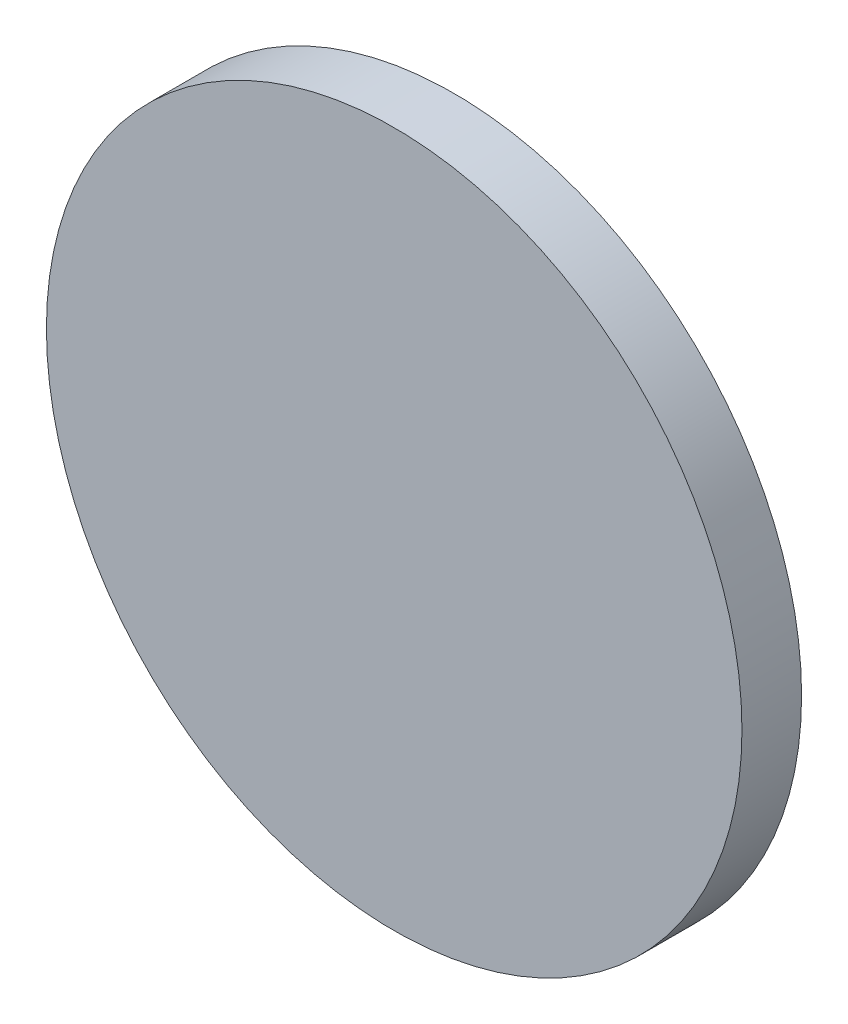
ISO-10303-21;
HEADER;
FILE_DESCRIPTION(('STEP AP214'),'2;1');
FILE_NAME('part.step','',(''),(''),'','','');
FILE_SCHEMA(('AUTOMOTIVE_DESIGN { 1 0 10303 214 1 1 1 1 }'));
ENDSEC;
DATA;
#1=APPLICATION_CONTEXT('core data for automotive mechanical design processes');
#2=APPLICATION_PROTOCOL_DEFINITION('international standard','automotive_design',2000,#1);
#3=PRODUCT_CONTEXT('',#1,'mechanical');
#4=PRODUCT('Part','Part','',(#3));
#5=PRODUCT_RELATED_PRODUCT_CATEGORY('part','',(#4));
#6=PRODUCT_DEFINITION_FORMATION('','',#4);
#7=PRODUCT_DEFINITION_CONTEXT('part definition',#1,'design');
#8=PRODUCT_DEFINITION('design','',#6,#7);
#9=PRODUCT_DEFINITION_SHAPE('','',#8);
#10=(LENGTH_UNIT() NAMED_UNIT(*) SI_UNIT(.MILLI.,.METRE.));
#11=(NAMED_UNIT(*) PLANE_ANGLE_UNIT() SI_UNIT($,.RADIAN.));
#12=(NAMED_UNIT(*) SI_UNIT($,.STERADIAN.) SOLID_ANGLE_UNIT());
#13=UNCERTAINTY_MEASURE_WITH_UNIT(LENGTH_MEASURE(1.E-05),#10,'distance_accuracy_value','');
#14=(GEOMETRIC_REPRESENTATION_CONTEXT(3) GLOBAL_UNCERTAINTY_ASSIGNED_CONTEXT((#13)) GLOBAL_UNIT_ASSIGNED_CONTEXT((#10,
#11,#12)) REPRESENTATION_CONTEXT('',''));
#15=CARTESIAN_POINT('',(0.,0.,0.));
#16=DIRECTION('',(0.,0.,1.));
#17=DIRECTION('',(1.,0.,0.));
#18=AXIS2_PLACEMENT_3D('',#15,#16,#17);
#19=CARTESIAN_POINT('',(11.59764,1.638300014875,0.76487));
#20=DIRECTION('',(0.,0.,-1.));
#21=DIRECTION('',(-1.,0.,0.));
#22=AXIS2_PLACEMENT_3D('',#19,#20,#21);
#23=PLANE('',#22);
#24=CARTESIAN_POINT('',(11.59764,1.638300014875,0.76487));
#25=DIRECTION('',(0.,0.,1.));
#26=DIRECTION('',(1.,0.,0.));
#27=AXIS2_PLACEMENT_3D('',#24,#25,#26);
#28=CIRCLE('',#27,0.200024667);
#29=CARTESIAN_POINT('',(11.797664667,1.638300014875,0.76487));
#30=VERTEX_POINT('',#29);
#31=EDGE_CURVE('E18',#30,#30,#28,.T.);
#32=ORIENTED_EDGE('',*,*,#31,.F.);
#33=EDGE_LOOP('',(#32));
#34=FACE_BOUND('',#33,.T.);
#35=ADVANCED_FACE('F15',(#34),#23,.T.);
#36=CARTESIAN_POINT('',(11.59764,1.638300014875,0.76487));
#37=DIRECTION('',(0.,0.,1.));
#38=DIRECTION('',(1.,0.,0.));
#39=AXIS2_PLACEMENT_3D('',#36,#37,#38);
#40=CYLINDRICAL_SURFACE('',#39,0.200024667);
#41=CARTESIAN_POINT('',(11.59764,1.638300014875,0.79916));
#42=DIRECTION('',(0.,0.,1.));
#43=DIRECTION('',(1.,0.,0.));
#44=AXIS2_PLACEMENT_3D('',#41,#42,#43);
#45=CIRCLE('',#44,0.200024667);
#46=CARTESIAN_POINT('',(11.797664667,1.638300014875,0.79916));
#47=VERTEX_POINT('',#46);
#48=EDGE_CURVE('E10',#47,#47,#45,.T.);
#49=ORIENTED_EDGE('',*,*,#48,.F.);
#50=EDGE_LOOP('',(#49));
#51=FACE_BOUND('',#50,.T.);
#52=ORIENTED_EDGE('',*,*,#31,.T.);
#53=EDGE_LOOP('',(#52));
#54=FACE_BOUND('',#53,.T.);
#55=ADVANCED_FACE('F27',(#51,#54),#40,.T.);
#56=CARTESIAN_POINT('',(11.59764,1.638300014875,0.79916));
#57=DIRECTION('',(0.,0.,1.));
#58=DIRECTION('',(1.,0.,0.));
#59=AXIS2_PLACEMENT_3D('',#56,#57,#58);
#60=PLANE('',#59);
#61=ORIENTED_EDGE('',*,*,#48,.T.);
#62=EDGE_LOOP('',(#61));
#63=FACE_BOUND('',#62,.T.);
#64=ADVANCED_FACE('F34',(#63),#60,.T.);
#65=CLOSED_SHELL('',(#35,#55,#64));
#66=MANIFOLD_SOLID_BREP('B1',#65);
#67=ADVANCED_BREP_SHAPE_REPRESENTATION('',(#18,#66),#14);
#68=SHAPE_DEFINITION_REPRESENTATION(#9,#67);
ENDSEC;
END-ISO-10303-21;
